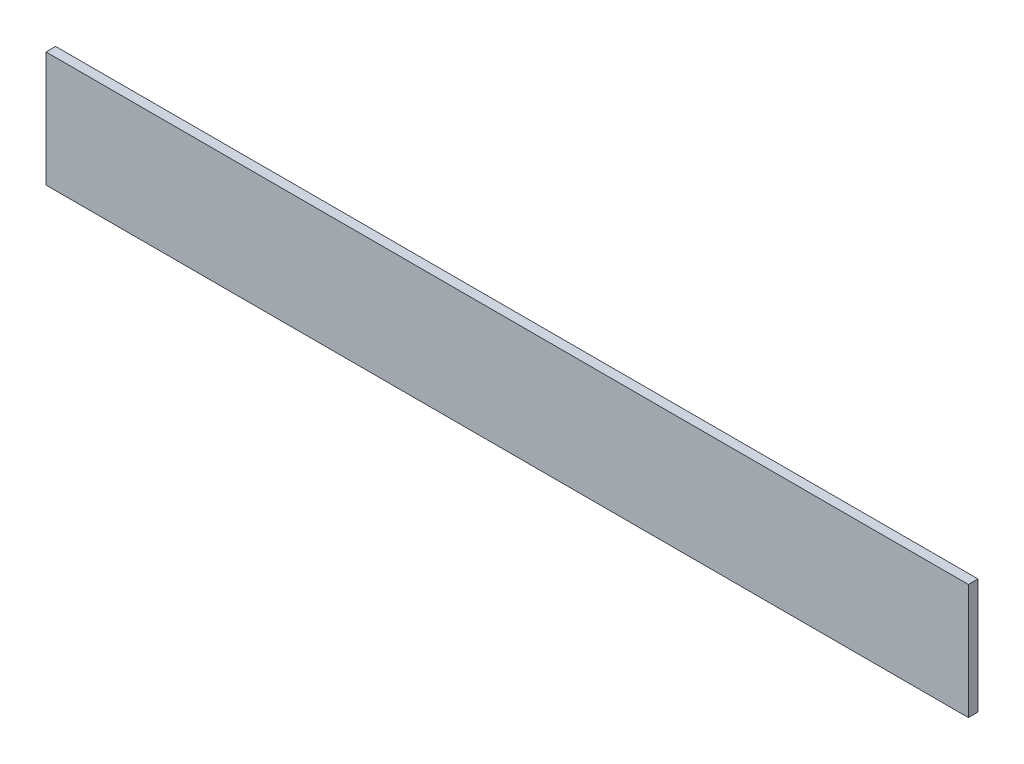
ISO-10303-21;
HEADER;
FILE_DESCRIPTION(('STEP AP214'),'2;1');
FILE_NAME('part.step','',(''),(''),'','','');
FILE_SCHEMA(('AUTOMOTIVE_DESIGN { 1 0 10303 214 1 1 1 1 }'));
ENDSEC;
DATA;
#1=APPLICATION_CONTEXT('core data for automotive mechanical design processes');
#2=APPLICATION_PROTOCOL_DEFINITION('international standard','automotive_design',2000,#1);
#3=PRODUCT_CONTEXT('',#1,'mechanical');
#4=PRODUCT('Part','Part','',(#3));
#5=PRODUCT_RELATED_PRODUCT_CATEGORY('part','',(#4));
#6=PRODUCT_DEFINITION_FORMATION('','',#4);
#7=PRODUCT_DEFINITION_CONTEXT('part definition',#1,'design');
#8=PRODUCT_DEFINITION('design','',#6,#7);
#9=PRODUCT_DEFINITION_SHAPE('','',#8);
#10=(LENGTH_UNIT() NAMED_UNIT(*) SI_UNIT(.MILLI.,.METRE.));
#11=(NAMED_UNIT(*) PLANE_ANGLE_UNIT() SI_UNIT($,.RADIAN.));
#12=(NAMED_UNIT(*) SI_UNIT($,.STERADIAN.) SOLID_ANGLE_UNIT());
#13=UNCERTAINTY_MEASURE_WITH_UNIT(LENGTH_MEASURE(1.E-05),#10,'distance_accuracy_value','');
#14=(GEOMETRIC_REPRESENTATION_CONTEXT(3) GLOBAL_UNCERTAINTY_ASSIGNED_CONTEXT((#13)) GLOBAL_UNIT_ASSIGNED_CONTEXT((#10,
#11,#12)) REPRESENTATION_CONTEXT('',''));
#15=CARTESIAN_POINT('',(0.,0.,0.));
#16=DIRECTION('',(0.,0.,1.));
#17=DIRECTION('',(1.,0.,0.));
#18=AXIS2_PLACEMENT_3D('',#15,#16,#17);
#19=CARTESIAN_POINT('',(304.8,-38.1,6.35));
#20=DIRECTION('',(-1.,0.,0.));
#21=DIRECTION('',(0.,0.,1.));
#22=AXIS2_PLACEMENT_3D('',#19,#20,#21);
#23=PLANE('',#22);
#24=DIRECTION('',(0.,1.,0.));
#25=VECTOR('',#24,1.);
#26=CARTESIAN_POINT('',(304.8,-38.1,0.));
#27=LINE('',#26,#25);
#28=CARTESIAN_POINT('',(304.8,-38.1,0.));
#29=VERTEX_POINT('',#28);
#30=CARTESIAN_POINT('',(304.8,38.1,0.));
#31=VERTEX_POINT('',#30);
#32=EDGE_CURVE('E96',#29,#31,#27,.T.);
#33=ORIENTED_EDGE('',*,*,#32,.T.);
#34=DIRECTION('',(0.,0.,-1.));
#35=VECTOR('',#34,1.);
#36=CARTESIAN_POINT('',(304.8,38.1,6.35));
#37=LINE('',#36,#35);
#38=CARTESIAN_POINT('',(304.8,38.1,6.35));
#39=VERTEX_POINT('',#38);
#40=EDGE_CURVE('E11',#39,#31,#37,.T.);
#41=ORIENTED_EDGE('',*,*,#40,.F.);
#42=DIRECTION('',(0.,1.,0.));
#43=VECTOR('',#42,1.);
#44=CARTESIAN_POINT('',(304.8,-38.1,6.35));
#45=LINE('',#44,#43);
#46=CARTESIAN_POINT('',(304.8,-38.1,6.35));
#47=VERTEX_POINT('',#46);
#48=EDGE_CURVE('E84',#47,#39,#45,.T.);
#49=ORIENTED_EDGE('',*,*,#48,.F.);
#50=DIRECTION('',(0.,0.,-1.));
#51=VECTOR('',#50,1.);
#52=CARTESIAN_POINT('',(304.8,-38.1,6.35));
#53=LINE('',#52,#51);
#54=EDGE_CURVE('E92',#47,#29,#53,.T.);
#55=ORIENTED_EDGE('',*,*,#54,.T.);
#56=EDGE_LOOP('',(#33,#41,#49,#55));
#57=FACE_BOUND('',#56,.T.);
#58=ADVANCED_FACE('F33',(#57),#23,.F.);
#59=CARTESIAN_POINT('',(-304.8,38.1,6.35));
#60=DIRECTION('',(0.,-1.,0.));
#61=DIRECTION('',(0.,0.,-1.));
#62=AXIS2_PLACEMENT_3D('',#59,#60,#61);
#63=PLANE('',#62);
#64=DIRECTION('',(-1.,0.,0.));
#65=VECTOR('',#64,1.);
#66=CARTESIAN_POINT('',(-304.8,38.1,0.));
#67=LINE('',#66,#65);
#68=CARTESIAN_POINT('',(-304.8,38.1,0.));
#69=VERTEX_POINT('',#68);
#70=EDGE_CURVE('E88',#31,#69,#67,.T.);
#71=ORIENTED_EDGE('',*,*,#70,.T.);
#72=DIRECTION('',(0.,0.,-1.));
#73=VECTOR('',#72,1.);
#74=CARTESIAN_POINT('',(-304.8,38.1,6.35));
#75=LINE('',#74,#73);
#76=CARTESIAN_POINT('',(-304.8,38.1,6.35));
#77=VERTEX_POINT('',#76);
#78=EDGE_CURVE('E41',#77,#69,#75,.T.);
#79=ORIENTED_EDGE('',*,*,#78,.F.);
#80=DIRECTION('',(-1.,0.,0.));
#81=VECTOR('',#80,1.);
#82=CARTESIAN_POINT('',(-304.8,38.1,6.35));
#83=LINE('',#82,#81);
#84=EDGE_CURVE('E79',#39,#77,#83,.T.);
#85=ORIENTED_EDGE('',*,*,#84,.F.);
#86=ORIENTED_EDGE('',*,*,#40,.T.);
#87=EDGE_LOOP('',(#71,#79,#85,#86));
#88=FACE_BOUND('',#87,.T.);
#89=ADVANCED_FACE('F87',(#88),#63,.F.);
#90=CARTESIAN_POINT('',(-304.8,-38.1,6.35));
#91=DIRECTION('',(1.,0.,0.));
#92=DIRECTION('',(0.,0.,-1.));
#93=AXIS2_PLACEMENT_3D('',#90,#91,#92);
#94=PLANE('',#93);
#95=DIRECTION('',(0.,-1.,0.));
#96=VECTOR('',#95,1.);
#97=CARTESIAN_POINT('',(-304.8,-38.1,0.));
#98=LINE('',#97,#96);
#99=CARTESIAN_POINT('',(-304.8,-38.1,0.));
#100=VERTEX_POINT('',#99);
#101=EDGE_CURVE('E66',#69,#100,#98,.T.);
#102=ORIENTED_EDGE('',*,*,#101,.T.);
#103=DIRECTION('',(0.,0.,-1.));
#104=VECTOR('',#103,1.);
#105=CARTESIAN_POINT('',(-304.8,-38.1,6.35));
#106=LINE('',#105,#104);
#107=CARTESIAN_POINT('',(-304.8,-38.1,6.35));
#108=VERTEX_POINT('',#107);
#109=EDGE_CURVE('E89',#108,#100,#106,.T.);
#110=ORIENTED_EDGE('',*,*,#109,.F.);
#111=DIRECTION('',(0.,-1.,0.));
#112=VECTOR('',#111,1.);
#113=CARTESIAN_POINT('',(-304.8,-38.1,6.35));
#114=LINE('',#113,#112);
#115=EDGE_CURVE('E82',#77,#108,#114,.T.);
#116=ORIENTED_EDGE('',*,*,#115,.F.);
#117=ORIENTED_EDGE('',*,*,#78,.T.);
#118=EDGE_LOOP('',(#102,#110,#116,#117));
#119=FACE_BOUND('',#118,.T.);
#120=ADVANCED_FACE('F90',(#119),#94,.F.);
#121=CARTESIAN_POINT('',(-304.8,-38.1,6.35));
#122=DIRECTION('',(0.,1.,0.));
#123=DIRECTION('',(0.,0.,1.));
#124=AXIS2_PLACEMENT_3D('',#121,#122,#123);
#125=PLANE('',#124);
#126=DIRECTION('',(1.,0.,0.));
#127=VECTOR('',#126,1.);
#128=CARTESIAN_POINT('',(-304.8,-38.1,0.));
#129=LINE('',#128,#127);
#130=EDGE_CURVE('E72',#100,#29,#129,.T.);
#131=ORIENTED_EDGE('',*,*,#130,.T.);
#132=ORIENTED_EDGE('',*,*,#54,.F.);
#133=DIRECTION('',(1.,0.,0.));
#134=VECTOR('',#133,1.);
#135=CARTESIAN_POINT('',(-304.8,-38.1,6.35));
#136=LINE('',#135,#134);
#137=EDGE_CURVE('E49',#108,#47,#136,.T.);
#138=ORIENTED_EDGE('',*,*,#137,.F.);
#139=ORIENTED_EDGE('',*,*,#109,.T.);
#140=EDGE_LOOP('',(#131,#132,#138,#139));
#141=FACE_BOUND('',#140,.T.);
#142=ADVANCED_FACE('F103',(#141),#125,.F.);
#143=CARTESIAN_POINT('',(304.8,38.1,6.35));
#144=DIRECTION('',(0.,0.,-1.));
#145=DIRECTION('',(-1.,0.,0.));
#146=AXIS2_PLACEMENT_3D('',#143,#144,#145);
#147=PLANE('',#146);
#148=ORIENTED_EDGE('',*,*,#48,.T.);
#149=ORIENTED_EDGE('',*,*,#84,.T.);
#150=ORIENTED_EDGE('',*,*,#115,.T.);
#151=ORIENTED_EDGE('',*,*,#137,.T.);
#152=EDGE_LOOP('',(#148,#149,#150,#151));
#153=FACE_BOUND('',#152,.T.);
#154=ADVANCED_FACE('F80',(#153),#147,.F.);
#155=CARTESIAN_POINT('',(304.8,38.1,0.));
#156=DIRECTION('',(0.,0.,-1.));
#157=DIRECTION('',(-1.,0.,0.));
#158=AXIS2_PLACEMENT_3D('',#155,#156,#157);
#159=PLANE('',#158);
#160=ORIENTED_EDGE('',*,*,#32,.F.);
#161=ORIENTED_EDGE('',*,*,#130,.F.);
#162=ORIENTED_EDGE('',*,*,#101,.F.);
#163=ORIENTED_EDGE('',*,*,#70,.F.);
#164=EDGE_LOOP('',(#160,#161,#162,#163));
#165=FACE_BOUND('',#164,.T.);
#166=ADVANCED_FACE('F106',(#165),#159,.T.);
#167=CLOSED_SHELL('',(#58,#89,#120,#142,#154,#166));
#168=MANIFOLD_SOLID_BREP('B2',#167);
#169=ADVANCED_BREP_SHAPE_REPRESENTATION('',(#18,#168),#14);
#170=SHAPE_DEFINITION_REPRESENTATION(#9,#169);
ENDSEC;
END-ISO-10303-21;
